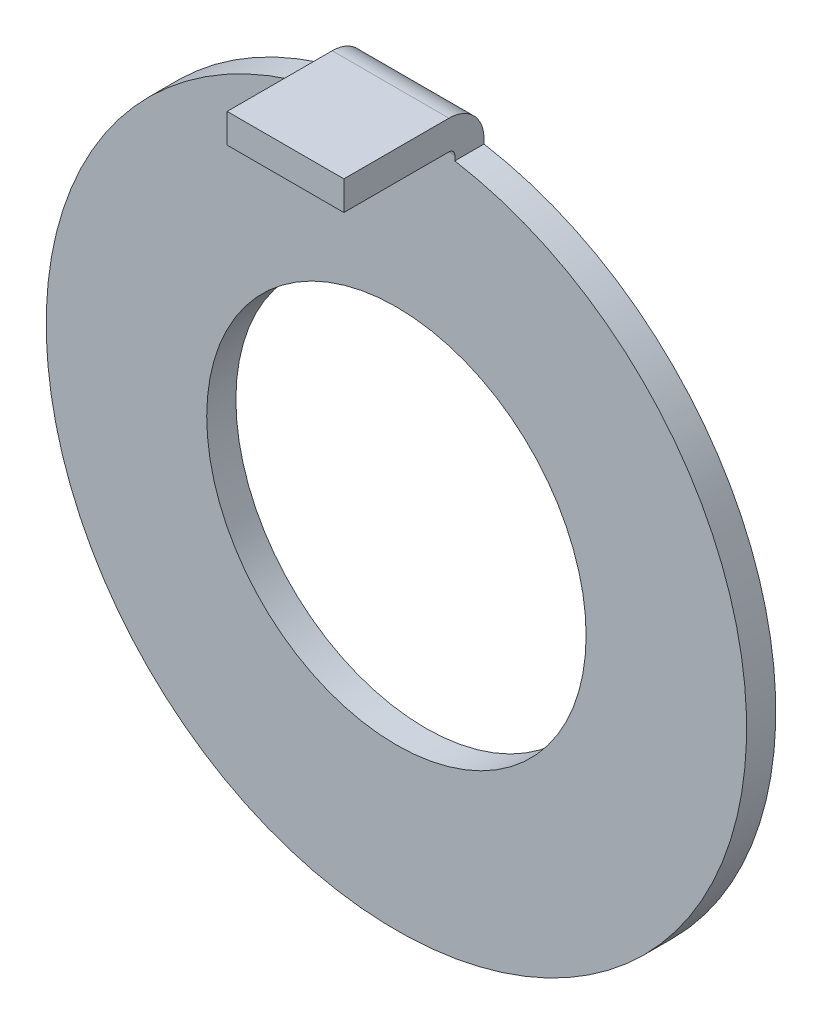
ISO-10303-21;
HEADER;
FILE_DESCRIPTION(('STEP AP214'),'2;1');
FILE_NAME('part.step','',(''),(''),'','','');
FILE_SCHEMA(('AUTOMOTIVE_DESIGN { 1 0 10303 214 1 1 1 1 }'));
ENDSEC;
DATA;
#1=APPLICATION_CONTEXT('core data for automotive mechanical design processes');
#2=APPLICATION_PROTOCOL_DEFINITION('international standard','automotive_design',2000,#1);
#3=PRODUCT_CONTEXT('',#1,'mechanical');
#4=PRODUCT('Part','Part','',(#3));
#5=PRODUCT_RELATED_PRODUCT_CATEGORY('part','',(#4));
#6=PRODUCT_DEFINITION_FORMATION('','',#4);
#7=PRODUCT_DEFINITION_CONTEXT('part definition',#1,'design');
#8=PRODUCT_DEFINITION('design','',#6,#7);
#9=PRODUCT_DEFINITION_SHAPE('','',#8);
#10=(LENGTH_UNIT() NAMED_UNIT(*) SI_UNIT(.MILLI.,.METRE.));
#11=(NAMED_UNIT(*) PLANE_ANGLE_UNIT() SI_UNIT($,.RADIAN.));
#12=(NAMED_UNIT(*) SI_UNIT($,.STERADIAN.) SOLID_ANGLE_UNIT());
#13=UNCERTAINTY_MEASURE_WITH_UNIT(LENGTH_MEASURE(1.E-05),#10,'distance_accuracy_value','');
#14=(GEOMETRIC_REPRESENTATION_CONTEXT(3) GLOBAL_UNCERTAINTY_ASSIGNED_CONTEXT((#13)) GLOBAL_UNIT_ASSIGNED_CONTEXT((#10,
#11,#12)) REPRESENTATION_CONTEXT('',''));
#15=CARTESIAN_POINT('',(0.,0.,0.));
#16=DIRECTION('',(0.,0.,1.));
#17=DIRECTION('',(1.,0.,0.));
#18=AXIS2_PLACEMENT_3D('',#15,#16,#17);
#19=CARTESIAN_POINT('',(0.,6.6,2.4));
#20=DIRECTION('',(0.,1.,0.));
#21=DIRECTION('',(0.,0.,1.));
#22=AXIS2_PLACEMENT_3D('',#19,#20,#21);
#23=PLANE('',#22);
#24=DIRECTION('',(0.,0.,-1.));
#25=VECTOR('',#24,1.);
#26=CARTESIAN_POINT('',(-1.,6.6,1.23213861339915));
#27=LINE('',#26,#25);
#28=CARTESIAN_POINT('',(-1.,6.6,0.6));
#29=VERTEX_POINT('',#28);
#30=CARTESIAN_POINT('',(-1.,6.6,2.4));
#31=VERTEX_POINT('',#30);
#32=EDGE_CURVE('E159',#29,#31,#27,.F.);
#33=ORIENTED_EDGE('',*,*,#32,.T.);
#34=DIRECTION('',(1.,0.,0.));
#35=VECTOR('',#34,1.);
#36=CARTESIAN_POINT('',(0.,6.6,2.4));
#37=LINE('',#36,#35);
#38=CARTESIAN_POINT('',(1.,6.6,2.4));
#39=VERTEX_POINT('',#38);
#40=EDGE_CURVE('E94',#39,#31,#37,.F.);
#41=ORIENTED_EDGE('',*,*,#40,.F.);
#42=DIRECTION('',(0.,0.,-1.));
#43=VECTOR('',#42,1.);
#44=CARTESIAN_POINT('',(1.,6.6,1.23213861339915));
#45=LINE('',#44,#43);
#46=CARTESIAN_POINT('',(1.,6.6,0.6));
#47=VERTEX_POINT('',#46);
#48=EDGE_CURVE('E130',#47,#39,#45,.F.);
#49=ORIENTED_EDGE('',*,*,#48,.F.);
#50=DIRECTION('',(1.,0.,0.));
#51=VECTOR('',#50,1.);
#52=CARTESIAN_POINT('',(0.,6.6,0.6));
#53=LINE('',#52,#51);
#54=EDGE_CURVE('E123',#29,#47,#53,.T.);
#55=ORIENTED_EDGE('',*,*,#54,.F.);
#56=EDGE_LOOP('',(#33,#41,#49,#55));
#57=FACE_BOUND('',#56,.T.);
#58=ADVANCED_FACE('F17',(#57),#23,.T.);
#59=CARTESIAN_POINT('',(1.,6.31530337091264,1.23213861339915));
#60=DIRECTION('',(1.,0.,0.));
#61=DIRECTION('',(0.,0.,-1.));
#62=AXIS2_PLACEMENT_3D('',#59,#60,#61);
#63=PLANE('',#62);
#64=DIRECTION('',(0.,0.,-1.));
#65=VECTOR('',#64,1.);
#66=CARTESIAN_POINT('',(1.,5.91607978309962,1.23213861339915));
#67=LINE('',#66,#65);
#68=CARTESIAN_POINT('',(1.,5.91607978309962,0.5));
#69=VERTEX_POINT('',#68);
#70=CARTESIAN_POINT('',(1.,5.91607978309962,0.));
#71=VERTEX_POINT('',#70);
#72=EDGE_CURVE('E127',#69,#71,#67,.T.);
#73=ORIENTED_EDGE('',*,*,#72,.T.);
#74=DIRECTION('',(0.,1.,0.));
#75=VECTOR('',#74,1.);
#76=CARTESIAN_POINT('',(1.,6.31530337091264,0.));
#77=LINE('',#76,#75);
#78=CARTESIAN_POINT('',(1.,6.,0.));
#79=VERTEX_POINT('',#78);
#80=EDGE_CURVE('E119',#71,#79,#77,.T.);
#81=ORIENTED_EDGE('',*,*,#80,.T.);
#82=CARTESIAN_POINT('',(1.,6.,0.6));
#83=DIRECTION('',(1.,0.,0.));
#84=DIRECTION('',(0.,0.,-1.));
#85=AXIS2_PLACEMENT_3D('',#82,#83,#84);
#86=CIRCLE('',#85,0.6);
#87=EDGE_CURVE('E157',#47,#79,#86,.F.);
#88=ORIENTED_EDGE('',*,*,#87,.F.);
#89=ORIENTED_EDGE('',*,*,#48,.T.);
#90=DIRECTION('',(0.,1.,0.));
#91=VECTOR('',#90,1.);
#92=CARTESIAN_POINT('',(1.,6.1,2.4));
#93=LINE('',#92,#91);
#94=CARTESIAN_POINT('',(1.,6.1,2.4));
#95=VERTEX_POINT('',#94);
#96=EDGE_CURVE('E117',#95,#39,#93,.T.);
#97=ORIENTED_EDGE('',*,*,#96,.F.);
#98=DIRECTION('',(0.,0.,-1.));
#99=VECTOR('',#98,1.);
#100=CARTESIAN_POINT('',(1.,6.1,0.6));
#101=LINE('',#100,#99);
#102=CARTESIAN_POINT('',(1.,6.1,0.6));
#103=VERTEX_POINT('',#102);
#104=EDGE_CURVE('E85',#103,#95,#101,.F.);
#105=ORIENTED_EDGE('',*,*,#104,.F.);
#106=CARTESIAN_POINT('',(1.,6.,0.6));
#107=DIRECTION('',(1.,0.,0.));
#108=DIRECTION('',(0.,0.,-1.));
#109=AXIS2_PLACEMENT_3D('',#106,#107,#108);
#110=CIRCLE('',#109,0.1);
#111=CARTESIAN_POINT('',(1.,6.,0.5));
#112=VERTEX_POINT('',#111);
#113=EDGE_CURVE('E20',#103,#112,#110,.F.);
#114=ORIENTED_EDGE('',*,*,#113,.T.);
#115=DIRECTION('',(0.,1.,0.));
#116=VECTOR('',#115,1.);
#117=CARTESIAN_POINT('',(1.,6.31530337091264,0.5));
#118=LINE('',#117,#116);
#119=EDGE_CURVE('E128',#112,#69,#118,.F.);
#120=ORIENTED_EDGE('',*,*,#119,.T.);
#121=EDGE_LOOP('',(#73,#81,#88,#89,#97,#105,#114,#120));
#122=FACE_BOUND('',#121,.T.);
#123=ADVANCED_FACE('F184',(#122),#63,.T.);
#124=CARTESIAN_POINT('',(0.,6.1,2.4));
#125=DIRECTION('',(0.,0.,1.));
#126=DIRECTION('',(1.,0.,0.));
#127=AXIS2_PLACEMENT_3D('',#124,#125,#126);
#128=PLANE('',#127);
#129=DIRECTION('',(0.,1.,0.));
#130=VECTOR('',#129,1.);
#131=CARTESIAN_POINT('',(-1.,6.31530337091265,2.4));
#132=LINE('',#131,#130);
#133=CARTESIAN_POINT('',(-1.,6.1,2.4));
#134=VERTEX_POINT('',#133);
#135=EDGE_CURVE('E91',#31,#134,#132,.F.);
#136=ORIENTED_EDGE('',*,*,#135,.T.);
#137=DIRECTION('',(1.,0.,0.));
#138=VECTOR('',#137,1.);
#139=CARTESIAN_POINT('',(0.,6.1,2.4));
#140=LINE('',#139,#138);
#141=EDGE_CURVE('E79',#95,#134,#140,.F.);
#142=ORIENTED_EDGE('',*,*,#141,.F.);
#143=ORIENTED_EDGE('',*,*,#96,.T.);
#144=ORIENTED_EDGE('',*,*,#40,.T.);
#145=EDGE_LOOP('',(#136,#142,#143,#144));
#146=FACE_BOUND('',#145,.T.);
#147=ADVANCED_FACE('F92',(#146),#128,.T.);
#148=CARTESIAN_POINT('',(-1.,6.31530337091265,1.23213861339915));
#149=DIRECTION('',(1.,0.,0.));
#150=DIRECTION('',(0.,0.,-1.));
#151=AXIS2_PLACEMENT_3D('',#148,#149,#150);
#152=PLANE('',#151);
#153=CARTESIAN_POINT('',(-1.,6.,0.6));
#154=DIRECTION('',(1.,0.,0.));
#155=DIRECTION('',(0.,0.,-1.));
#156=AXIS2_PLACEMENT_3D('',#153,#154,#155);
#157=CIRCLE('',#156,0.6);
#158=CARTESIAN_POINT('',(-1.,6.,0.));
#159=VERTEX_POINT('',#158);
#160=EDGE_CURVE('E136',#159,#29,#157,.T.);
#161=ORIENTED_EDGE('',*,*,#160,.F.);
#162=DIRECTION('',(0.,1.,0.));
#163=VECTOR('',#162,1.);
#164=CARTESIAN_POINT('',(-1.,6.31530337091265,0.));
#165=LINE('',#164,#163);
#166=CARTESIAN_POINT('',(-1.,5.91607978309962,0.));
#167=VERTEX_POINT('',#166);
#168=EDGE_CURVE('E140',#167,#159,#165,.T.);
#169=ORIENTED_EDGE('',*,*,#168,.F.);
#170=DIRECTION('',(0.,0.,-1.));
#171=VECTOR('',#170,1.);
#172=CARTESIAN_POINT('',(-1.,5.91607978309962,1.23213861339915));
#173=LINE('',#172,#171);
#174=CARTESIAN_POINT('',(-1.,5.91607978309962,0.5));
#175=VERTEX_POINT('',#174);
#176=EDGE_CURVE('E137',#175,#167,#173,.T.);
#177=ORIENTED_EDGE('',*,*,#176,.F.);
#178=DIRECTION('',(0.,1.,0.));
#179=VECTOR('',#178,1.);
#180=CARTESIAN_POINT('',(-1.,6.31530337091265,0.5));
#181=LINE('',#180,#179);
#182=CARTESIAN_POINT('',(-1.,6.,0.5));
#183=VERTEX_POINT('',#182);
#184=EDGE_CURVE('E141',#183,#175,#181,.F.);
#185=ORIENTED_EDGE('',*,*,#184,.F.);
#186=CARTESIAN_POINT('',(-1.,6.,0.6));
#187=DIRECTION('',(1.,0.,0.));
#188=DIRECTION('',(0.,0.,-1.));
#189=AXIS2_PLACEMENT_3D('',#186,#187,#188);
#190=CIRCLE('',#189,0.1);
#191=CARTESIAN_POINT('',(-1.,6.1,0.6));
#192=VERTEX_POINT('',#191);
#193=EDGE_CURVE('E97',#192,#183,#190,.F.);
#194=ORIENTED_EDGE('',*,*,#193,.F.);
#195=DIRECTION('',(0.,0.,-1.));
#196=VECTOR('',#195,1.);
#197=CARTESIAN_POINT('',(-1.,6.1,0.6));
#198=LINE('',#197,#196);
#199=EDGE_CURVE('E84',#134,#192,#198,.T.);
#200=ORIENTED_EDGE('',*,*,#199,.F.);
#201=ORIENTED_EDGE('',*,*,#135,.F.);
#202=ORIENTED_EDGE('',*,*,#32,.F.);
#203=EDGE_LOOP('',(#161,#169,#177,#185,#194,#200,#201,#202));
#204=FACE_BOUND('',#203,.T.);
#205=ADVANCED_FACE('F100',(#204),#152,.F.);
#206=CARTESIAN_POINT('',(0.,6.,0.6));
#207=DIRECTION('',(1.,0.,0.));
#208=DIRECTION('',(0.,0.,-1.));
#209=AXIS2_PLACEMENT_3D('',#206,#207,#208);
#210=CYLINDRICAL_SURFACE('',#209,0.6);
#211=ORIENTED_EDGE('',*,*,#160,.T.);
#212=ORIENTED_EDGE('',*,*,#54,.T.);
#213=ORIENTED_EDGE('',*,*,#87,.T.);
#214=DIRECTION('',(-1.,0.,0.));
#215=VECTOR('',#214,1.);
#216=CARTESIAN_POINT('',(0.,6.,0.));
#217=LINE('',#216,#215);
#218=EDGE_CURVE('E102',#159,#79,#217,.F.);
#219=ORIENTED_EDGE('',*,*,#218,.F.);
#220=EDGE_LOOP('',(#211,#212,#213,#219));
#221=FACE_BOUND('',#220,.T.);
#222=ADVANCED_FACE('F172',(#221),#210,.T.);
#223=CARTESIAN_POINT('',(0.,6.1,0.6));
#224=DIRECTION('',(0.,-1.,0.));
#225=DIRECTION('',(0.,0.,-1.));
#226=AXIS2_PLACEMENT_3D('',#223,#224,#225);
#227=PLANE('',#226);
#228=ORIENTED_EDGE('',*,*,#199,.T.);
#229=DIRECTION('',(1.,0.,0.));
#230=VECTOR('',#229,1.);
#231=CARTESIAN_POINT('',(0.,6.1,0.6));
#232=LINE('',#231,#230);
#233=EDGE_CURVE('E109',#192,#103,#232,.T.);
#234=ORIENTED_EDGE('',*,*,#233,.T.);
#235=ORIENTED_EDGE('',*,*,#104,.T.);
#236=ORIENTED_EDGE('',*,*,#141,.T.);
#237=EDGE_LOOP('',(#228,#234,#235,#236));
#238=FACE_BOUND('',#237,.T.);
#239=ADVANCED_FACE('F81',(#238),#227,.T.);
#240=CARTESIAN_POINT('',(0.,0.,0.));
#241=DIRECTION('',(0.,0.,-1.));
#242=DIRECTION('',(-1.,0.,0.));
#243=AXIS2_PLACEMENT_3D('',#240,#241,#242);
#244=PLANE('',#243);
#245=CARTESIAN_POINT('',(0.,0.,0.));
#246=DIRECTION('',(0.,0.,1.));
#247=DIRECTION('',(1.,0.,0.));
#248=AXIS2_PLACEMENT_3D('',#245,#246,#247);
#249=CIRCLE('',#248,3.25);
#250=CARTESIAN_POINT('',(3.25,0.,0.));
#251=VERTEX_POINT('',#250);
#252=EDGE_CURVE('E150',#251,#251,#249,.T.);
#253=ORIENTED_EDGE('',*,*,#252,.T.);
#254=EDGE_LOOP('',(#253));
#255=FACE_BOUND('',#254,.T.);
#256=ORIENTED_EDGE('',*,*,#218,.T.);
#257=ORIENTED_EDGE('',*,*,#80,.F.);
#258=CARTESIAN_POINT('',(0.,0.,0.));
#259=DIRECTION('',(0.,0.,1.));
#260=DIRECTION('',(1.,0.,0.));
#261=AXIS2_PLACEMENT_3D('',#258,#259,#260);
#262=CIRCLE('',#261,6.);
#263=EDGE_CURVE('E105',#167,#71,#262,.T.);
#264=ORIENTED_EDGE('',*,*,#263,.F.);
#265=ORIENTED_EDGE('',*,*,#168,.T.);
#266=EDGE_LOOP('',(#256,#257,#264,#265));
#267=FACE_BOUND('',#266,.T.);
#268=ADVANCED_FACE('F176',(#255,#267),#244,.T.);
#269=CARTESIAN_POINT('',(0.,0.,0.));
#270=DIRECTION('',(0.,0.,1.));
#271=DIRECTION('',(1.,0.,0.));
#272=AXIS2_PLACEMENT_3D('',#269,#270,#271);
#273=CYLINDRICAL_SURFACE('',#272,6.);
#274=ORIENTED_EDGE('',*,*,#176,.T.);
#275=ORIENTED_EDGE('',*,*,#263,.T.);
#276=ORIENTED_EDGE('',*,*,#72,.F.);
#277=CARTESIAN_POINT('',(0.,0.,0.5));
#278=DIRECTION('',(0.,0.,1.));
#279=DIRECTION('',(1.,0.,0.));
#280=AXIS2_PLACEMENT_3D('',#277,#278,#279);
#281=CIRCLE('',#280,6.);
#282=EDGE_CURVE('E143',#69,#175,#281,.F.);
#283=ORIENTED_EDGE('',*,*,#282,.T.);
#284=EDGE_LOOP('',(#274,#275,#276,#283));
#285=FACE_BOUND('',#284,.T.);
#286=ADVANCED_FACE('F180',(#285),#273,.T.);
#287=CARTESIAN_POINT('',(0.,6.,0.6));
#288=DIRECTION('',(1.,0.,0.));
#289=DIRECTION('',(0.,0.,-1.));
#290=AXIS2_PLACEMENT_3D('',#287,#288,#289);
#291=CYLINDRICAL_SURFACE('',#290,0.1);
#292=ORIENTED_EDGE('',*,*,#233,.F.);
#293=ORIENTED_EDGE('',*,*,#193,.T.);
#294=DIRECTION('',(-1.,0.,0.));
#295=VECTOR('',#294,1.);
#296=CARTESIAN_POINT('',(0.,6.,0.5));
#297=LINE('',#296,#295);
#298=EDGE_CURVE('E26',#183,#112,#297,.F.);
#299=ORIENTED_EDGE('',*,*,#298,.T.);
#300=ORIENTED_EDGE('',*,*,#113,.F.);
#301=EDGE_LOOP('',(#292,#293,#299,#300));
#302=FACE_BOUND('',#301,.T.);
#303=ADVANCED_FACE('F185',(#302),#291,.F.);
#304=CARTESIAN_POINT('',(0.,0.,0.));
#305=DIRECTION('',(0.,0.,1.));
#306=DIRECTION('',(1.,0.,0.));
#307=AXIS2_PLACEMENT_3D('',#304,#305,#306);
#308=CYLINDRICAL_SURFACE('',#307,3.25);
#309=ORIENTED_EDGE('',*,*,#252,.F.);
#310=EDGE_LOOP('',(#309));
#311=FACE_BOUND('',#310,.T.);
#312=CARTESIAN_POINT('',(0.,0.,0.5));
#313=DIRECTION('',(0.,0.,1.));
#314=DIRECTION('',(1.,0.,0.));
#315=AXIS2_PLACEMENT_3D('',#312,#313,#314);
#316=CIRCLE('',#315,3.25);
#317=CARTESIAN_POINT('',(3.25,0.,0.5));
#318=VERTEX_POINT('',#317);
#319=EDGE_CURVE('E11',#318,#318,#316,.T.);
#320=ORIENTED_EDGE('',*,*,#319,.T.);
#321=EDGE_LOOP('',(#320));
#322=FACE_BOUND('',#321,.T.);
#323=ADVANCED_FACE('F187',(#311,#322),#308,.F.);
#324=CARTESIAN_POINT('',(0.,0.,0.5));
#325=DIRECTION('',(0.,0.,-1.));
#326=DIRECTION('',(-1.,0.,0.));
#327=AXIS2_PLACEMENT_3D('',#324,#325,#326);
#328=PLANE('',#327);
#329=ORIENTED_EDGE('',*,*,#319,.F.);
#330=EDGE_LOOP('',(#329));
#331=FACE_BOUND('',#330,.T.);
#332=ORIENTED_EDGE('',*,*,#184,.T.);
#333=ORIENTED_EDGE('',*,*,#282,.F.);
#334=ORIENTED_EDGE('',*,*,#119,.F.);
#335=ORIENTED_EDGE('',*,*,#298,.F.);
#336=EDGE_LOOP('',(#332,#333,#334,#335));
#337=FACE_BOUND('',#336,.T.);
#338=ADVANCED_FACE('F182',(#331,#337),#328,.F.);
#339=CLOSED_SHELL('',(#58,#123,#147,#205,#222,#239,#268,#286,#303,#323,#338));
#340=MANIFOLD_SOLID_BREP('B1',#339);
#341=ADVANCED_BREP_SHAPE_REPRESENTATION('',(#18,#340),#14);
#342=SHAPE_DEFINITION_REPRESENTATION(#9,#341);
ENDSEC;
END-ISO-10303-21;
